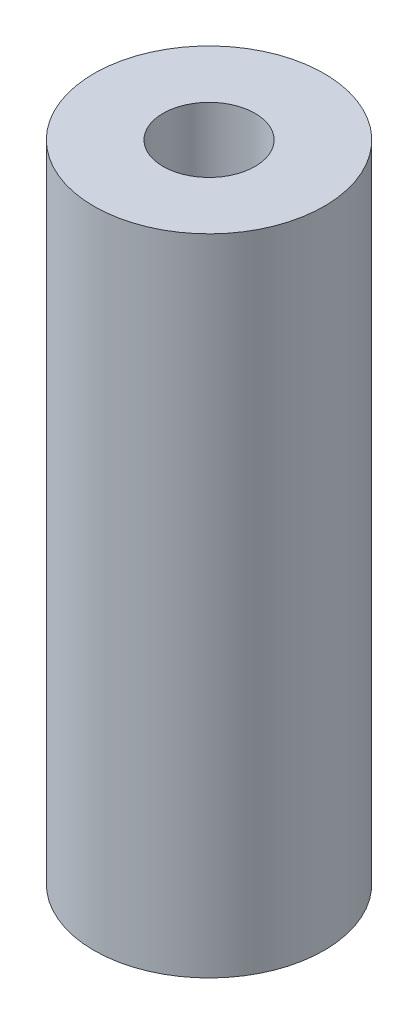
ISO-10303-21;
HEADER;
FILE_DESCRIPTION(('STEP AP214'),'2;1');
FILE_NAME('part.step','',(''),(''),'','','');
FILE_SCHEMA(('AUTOMOTIVE_DESIGN { 1 0 10303 214 1 1 1 1 }'));
ENDSEC;
DATA;
#1=APPLICATION_CONTEXT('core data for automotive mechanical design processes');
#2=APPLICATION_PROTOCOL_DEFINITION('international standard','automotive_design',2000,#1);
#3=PRODUCT_CONTEXT('',#1,'mechanical');
#4=PRODUCT('Part','Part','',(#3));
#5=PRODUCT_RELATED_PRODUCT_CATEGORY('part','',(#4));
#6=PRODUCT_DEFINITION_FORMATION('','',#4);
#7=PRODUCT_DEFINITION_CONTEXT('part definition',#1,'design');
#8=PRODUCT_DEFINITION('design','',#6,#7);
#9=PRODUCT_DEFINITION_SHAPE('','',#8);
#10=(LENGTH_UNIT() NAMED_UNIT(*) SI_UNIT(.MILLI.,.METRE.));
#11=(NAMED_UNIT(*) PLANE_ANGLE_UNIT() SI_UNIT($,.RADIAN.));
#12=(NAMED_UNIT(*) SI_UNIT($,.STERADIAN.) SOLID_ANGLE_UNIT());
#13=UNCERTAINTY_MEASURE_WITH_UNIT(LENGTH_MEASURE(1.E-05),#10,'distance_accuracy_value','');
#14=(GEOMETRIC_REPRESENTATION_CONTEXT(3) GLOBAL_UNCERTAINTY_ASSIGNED_CONTEXT((#13)) GLOBAL_UNIT_ASSIGNED_CONTEXT((#10,
#11,#12)) REPRESENTATION_CONTEXT('',''));
#15=CARTESIAN_POINT('',(0.,0.,0.));
#16=DIRECTION('',(0.,0.,1.));
#17=DIRECTION('',(1.,0.,0.));
#18=AXIS2_PLACEMENT_3D('',#15,#16,#17);
#19=CARTESIAN_POINT('',(0.,14.,0.));
#20=DIRECTION('',(0.,1.,0.));
#21=DIRECTION('',(0.,0.,1.));
#22=AXIS2_PLACEMENT_3D('',#19,#20,#21);
#23=PLANE('',#22);
#24=CARTESIAN_POINT('',(0.,14.,0.));
#25=DIRECTION('',(0.,1.,0.));
#26=DIRECTION('',(0.,0.,1.));
#27=AXIS2_PLACEMENT_3D('',#24,#25,#26);
#28=CIRCLE('',#27,2.5);
#29=CARTESIAN_POINT('',(0.,14.,2.5));
#30=VERTEX_POINT('',#29);
#31=EDGE_CURVE('E10',#30,#30,#28,.T.);
#32=ORIENTED_EDGE('',*,*,#31,.T.);
#33=EDGE_LOOP('',(#32));
#34=FACE_BOUND('',#33,.T.);
#35=CARTESIAN_POINT('',(0.,14.,0.));
#36=DIRECTION('',(0.,1.,0.));
#37=DIRECTION('',(0.,0.,1.));
#38=AXIS2_PLACEMENT_3D('',#35,#36,#37);
#39=CIRCLE('',#38,1.);
#40=CARTESIAN_POINT('',(0.,14.,1.));
#41=VERTEX_POINT('',#40);
#42=EDGE_CURVE('E48',#41,#41,#39,.T.);
#43=ORIENTED_EDGE('',*,*,#42,.F.);
#44=EDGE_LOOP('',(#43));
#45=FACE_BOUND('',#44,.T.);
#46=ADVANCED_FACE('F37',(#34,#45),#23,.T.);
#47=CARTESIAN_POINT('',(0.,0.,0.));
#48=DIRECTION('',(0.,1.,0.));
#49=DIRECTION('',(0.,0.,1.));
#50=AXIS2_PLACEMENT_3D('',#47,#48,#49);
#51=PLANE('',#50);
#52=CARTESIAN_POINT('',(0.,0.,0.));
#53=DIRECTION('',(0.,1.,0.));
#54=DIRECTION('',(0.,0.,1.));
#55=AXIS2_PLACEMENT_3D('',#52,#53,#54);
#56=CIRCLE('',#55,2.5);
#57=CARTESIAN_POINT('',(0.,0.,2.5));
#58=VERTEX_POINT('',#57);
#59=EDGE_CURVE('E41',#58,#58,#56,.T.);
#60=ORIENTED_EDGE('',*,*,#59,.F.);
#61=EDGE_LOOP('',(#60));
#62=FACE_BOUND('',#61,.T.);
#63=CARTESIAN_POINT('',(0.,0.,0.));
#64=DIRECTION('',(0.,1.,0.));
#65=DIRECTION('',(0.,0.,1.));
#66=AXIS2_PLACEMENT_3D('',#63,#64,#65);
#67=CIRCLE('',#66,1.);
#68=CARTESIAN_POINT('',(0.,0.,1.));
#69=VERTEX_POINT('',#68);
#70=EDGE_CURVE('E50',#69,#69,#67,.T.);
#71=ORIENTED_EDGE('',*,*,#70,.T.);
#72=EDGE_LOOP('',(#71));
#73=FACE_BOUND('',#72,.T.);
#74=ADVANCED_FACE('F60',(#62,#73),#51,.F.);
#75=CARTESIAN_POINT('',(0.,14.,0.));
#76=DIRECTION('',(0.,-1.,0.));
#77=DIRECTION('',(0.,0.,-1.));
#78=AXIS2_PLACEMENT_3D('',#75,#76,#77);
#79=CYLINDRICAL_SURFACE('',#78,2.5);
#80=ORIENTED_EDGE('',*,*,#31,.F.);
#81=EDGE_LOOP('',(#80));
#82=FACE_BOUND('',#81,.T.);
#83=ORIENTED_EDGE('',*,*,#59,.T.);
#84=EDGE_LOOP('',(#83));
#85=FACE_BOUND('',#84,.T.);
#86=ADVANCED_FACE('F39',(#82,#85),#79,.T.);
#87=CARTESIAN_POINT('',(0.,14.,0.));
#88=DIRECTION('',(0.,-1.,0.));
#89=DIRECTION('',(0.,0.,-1.));
#90=AXIS2_PLACEMENT_3D('',#87,#88,#89);
#91=CYLINDRICAL_SURFACE('',#90,1.);
#92=ORIENTED_EDGE('',*,*,#42,.T.);
#93=EDGE_LOOP('',(#92));
#94=FACE_BOUND('',#93,.T.);
#95=ORIENTED_EDGE('',*,*,#70,.F.);
#96=EDGE_LOOP('',(#95));
#97=FACE_BOUND('',#96,.T.);
#98=ADVANCED_FACE('F56',(#94,#97),#91,.F.);
#99=CLOSED_SHELL('',(#46,#74,#86,#98));
#100=MANIFOLD_SOLID_BREP('B2',#99);
#101=ADVANCED_BREP_SHAPE_REPRESENTATION('',(#18,#100),#14);
#102=SHAPE_DEFINITION_REPRESENTATION(#9,#101);
ENDSEC;
END-ISO-10303-21;
